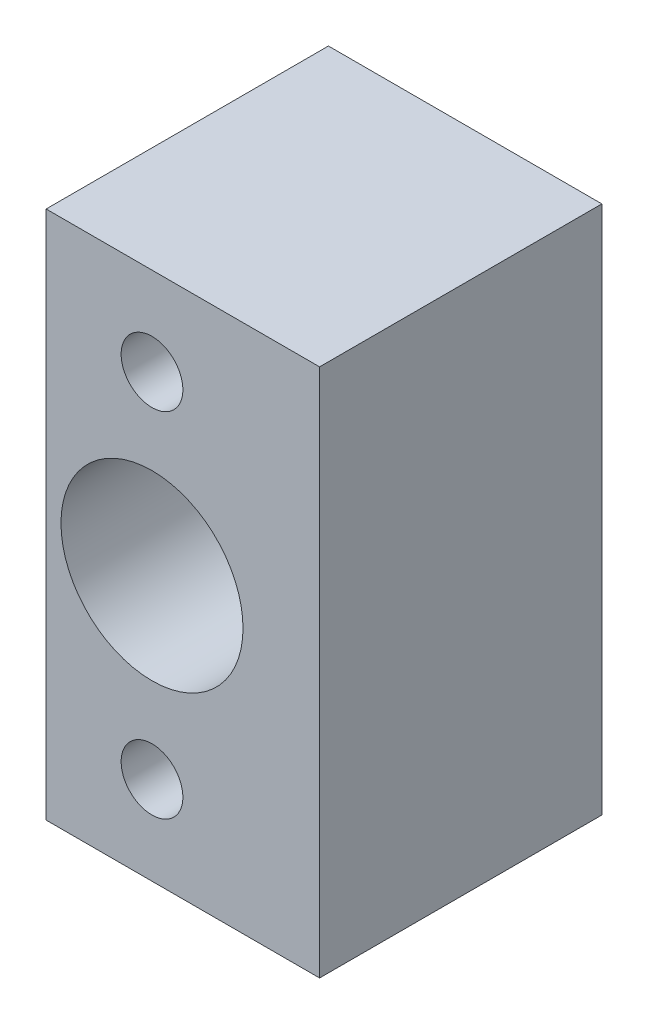
ISO-10303-21;
HEADER;
FILE_DESCRIPTION(('STEP AP214'),'2;1');
FILE_NAME('part.step','',(''),(''),'','','');
FILE_SCHEMA(('AUTOMOTIVE_DESIGN { 1 0 10303 214 1 1 1 1 }'));
ENDSEC;
DATA;
#1=APPLICATION_CONTEXT('core data for automotive mechanical design processes');
#2=APPLICATION_PROTOCOL_DEFINITION('international standard','automotive_design',2000,#1);
#3=PRODUCT_CONTEXT('',#1,'mechanical');
#4=PRODUCT('Part','Part','',(#3));
#5=PRODUCT_RELATED_PRODUCT_CATEGORY('part','',(#4));
#6=PRODUCT_DEFINITION_FORMATION('','',#4);
#7=PRODUCT_DEFINITION_CONTEXT('part definition',#1,'design');
#8=PRODUCT_DEFINITION('design','',#6,#7);
#9=PRODUCT_DEFINITION_SHAPE('','',#8);
#10=(LENGTH_UNIT() NAMED_UNIT(*) SI_UNIT(.MILLI.,.METRE.));
#11=(NAMED_UNIT(*) PLANE_ANGLE_UNIT() SI_UNIT($,.RADIAN.));
#12=(NAMED_UNIT(*) SI_UNIT($,.STERADIAN.) SOLID_ANGLE_UNIT());
#13=UNCERTAINTY_MEASURE_WITH_UNIT(LENGTH_MEASURE(1.E-05),#10,'distance_accuracy_value','');
#14=(GEOMETRIC_REPRESENTATION_CONTEXT(3) GLOBAL_UNCERTAINTY_ASSIGNED_CONTEXT((#13)) GLOBAL_UNIT_ASSIGNED_CONTEXT((#10,
#11,#12)) REPRESENTATION_CONTEXT('',''));
#15=CARTESIAN_POINT('',(0.,0.,0.));
#16=DIRECTION('',(0.,0.,1.));
#17=DIRECTION('',(1.,0.,0.));
#18=AXIS2_PLACEMENT_3D('',#15,#16,#17);
#19=CARTESIAN_POINT('',(0.,9.99999999999999,18.));
#20=DIRECTION('',(0.,0.,-1.));
#21=DIRECTION('',(-1.,0.,0.));
#22=AXIS2_PLACEMENT_3D('',#19,#20,#21);
#23=CYLINDRICAL_SURFACE('',#22,1.75);
#24=CARTESIAN_POINT('',(0.,9.99999999999999,16.));
#25=DIRECTION('',(0.,0.,-1.));
#26=DIRECTION('',(-1.,0.,0.));
#27=AXIS2_PLACEMENT_3D('',#24,#25,#26);
#28=CIRCLE('',#27,1.75);
#29=CARTESIAN_POINT('',(-1.75,9.99999999999999,16.));
#30=VERTEX_POINT('',#29);
#31=EDGE_CURVE('E129',#30,#30,#28,.F.);
#32=ORIENTED_EDGE('',*,*,#31,.T.);
#33=EDGE_LOOP('',(#32));
#34=FACE_BOUND('',#33,.T.);
#35=CARTESIAN_POINT('',(0.,9.99999999999999,4.));
#36=DIRECTION('',(0.,0.,-1.));
#37=DIRECTION('',(-1.,0.,0.));
#38=AXIS2_PLACEMENT_3D('',#35,#36,#37);
#39=CIRCLE('',#38,1.75);
#40=CARTESIAN_POINT('',(-1.75,9.99999999999999,4.));
#41=VERTEX_POINT('',#40);
#42=EDGE_CURVE('E42',#41,#41,#39,.F.);
#43=ORIENTED_EDGE('',*,*,#42,.F.);
#44=EDGE_LOOP('',(#43));
#45=FACE_BOUND('',#44,.T.);
#46=ADVANCED_FACE('F38',(#34,#45),#23,.F.);
#47=CARTESIAN_POINT('',(0.,-10.,18.));
#48=DIRECTION('',(0.,0.,-1.));
#49=DIRECTION('',(-1.,0.,0.));
#50=AXIS2_PLACEMENT_3D('',#47,#48,#49);
#51=CYLINDRICAL_SURFACE('',#50,1.75);
#52=CARTESIAN_POINT('',(0.,-10.,16.));
#53=DIRECTION('',(0.,0.,-1.));
#54=DIRECTION('',(-1.,0.,0.));
#55=AXIS2_PLACEMENT_3D('',#52,#53,#54);
#56=CIRCLE('',#55,1.75);
#57=CARTESIAN_POINT('',(-1.75,-10.,16.));
#58=VERTEX_POINT('',#57);
#59=EDGE_CURVE('E127',#58,#58,#56,.F.);
#60=ORIENTED_EDGE('',*,*,#59,.T.);
#61=EDGE_LOOP('',(#60));
#62=FACE_BOUND('',#61,.T.);
#63=CARTESIAN_POINT('',(0.,-10.,4.));
#64=DIRECTION('',(0.,0.,-1.));
#65=DIRECTION('',(-1.,0.,0.));
#66=AXIS2_PLACEMENT_3D('',#63,#64,#65);
#67=CIRCLE('',#66,1.75);
#68=CARTESIAN_POINT('',(-1.75,-10.,4.));
#69=VERTEX_POINT('',#68);
#70=EDGE_CURVE('E131',#69,#69,#67,.F.);
#71=ORIENTED_EDGE('',*,*,#70,.F.);
#72=EDGE_LOOP('',(#71));
#73=FACE_BOUND('',#72,.T.);
#74=ADVANCED_FACE('F184',(#62,#73),#51,.F.);
#75=CARTESIAN_POINT('',(0.,0.,2.9));
#76=DIRECTION('',(0.,0.,-1.));
#77=DIRECTION('',(-1.,0.,0.));
#78=AXIS2_PLACEMENT_3D('',#75,#76,#77);
#79=CYLINDRICAL_SURFACE('',#78,4.);
#80=CARTESIAN_POINT('',(0.,0.,2.9));
#81=DIRECTION('',(0.,0.,-1.));
#82=DIRECTION('',(-1.,0.,0.));
#83=AXIS2_PLACEMENT_3D('',#80,#81,#82);
#84=CIRCLE('',#83,4.);
#85=CARTESIAN_POINT('',(-4.,0.,2.9));
#86=VERTEX_POINT('',#85);
#87=EDGE_CURVE('E109',#86,#86,#84,.T.);
#88=ORIENTED_EDGE('',*,*,#87,.F.);
#89=EDGE_LOOP('',(#88));
#90=FACE_BOUND('',#89,.T.);
#91=CARTESIAN_POINT('',(0.,0.,0.));
#92=DIRECTION('',(0.,0.,-1.));
#93=DIRECTION('',(-1.,0.,0.));
#94=AXIS2_PLACEMENT_3D('',#91,#92,#93);
#95=CIRCLE('',#94,4.);
#96=CARTESIAN_POINT('',(-4.,0.,0.));
#97=VERTEX_POINT('',#96);
#98=EDGE_CURVE('E159',#97,#97,#95,.F.);
#99=ORIENTED_EDGE('',*,*,#98,.F.);
#100=EDGE_LOOP('',(#99));
#101=FACE_BOUND('',#100,.T.);
#102=ADVANCED_FACE('F180',(#90,#101),#79,.F.);
#103=CARTESIAN_POINT('',(0.,0.,18.));
#104=DIRECTION('',(0.,0.,-1.));
#105=DIRECTION('',(-1.,0.,0.));
#106=AXIS2_PLACEMENT_3D('',#103,#104,#105);
#107=CYLINDRICAL_SURFACE('',#106,2.38125);
#108=CARTESIAN_POINT('',(0.,0.,5.99999999999999));
#109=DIRECTION('',(0.,0.,1.));
#110=DIRECTION('',(1.,0.,0.));
#111=AXIS2_PLACEMENT_3D('',#108,#109,#110);
#112=CIRCLE('',#111,2.38125);
#113=CARTESIAN_POINT('',(2.38125,0.,5.99999999999999));
#114=VERTEX_POINT('',#113);
#115=EDGE_CURVE('E100',#114,#114,#112,.F.);
#116=ORIENTED_EDGE('',*,*,#115,.F.);
#117=EDGE_LOOP('',(#116));
#118=FACE_BOUND('',#117,.T.);
#119=CARTESIAN_POINT('',(0.,0.,2.9));
#120=DIRECTION('',(0.,0.,-1.));
#121=DIRECTION('',(-1.,0.,0.));
#122=AXIS2_PLACEMENT_3D('',#119,#120,#121);
#123=CIRCLE('',#122,2.38125);
#124=CARTESIAN_POINT('',(-2.38125,0.,2.9));
#125=VERTEX_POINT('',#124);
#126=EDGE_CURVE('E106',#125,#125,#123,.T.);
#127=ORIENTED_EDGE('',*,*,#126,.T.);
#128=EDGE_LOOP('',(#127));
#129=FACE_BOUND('',#128,.T.);
#130=ADVANCED_FACE('F183',(#118,#129),#107,.F.);
#131=CARTESIAN_POINT('',(0.,0.,6.5));
#132=DIRECTION('',(0.,0.,1.));
#133=DIRECTION('',(1.,0.,0.));
#134=AXIS2_PLACEMENT_3D('',#131,#132,#133);
#135=CYLINDRICAL_SURFACE('',#134,5.159375);
#136=CARTESIAN_POINT('',(0.,0.,16.));
#137=DIRECTION('',(0.,0.,-1.));
#138=DIRECTION('',(-1.,0.,0.));
#139=AXIS2_PLACEMENT_3D('',#136,#137,#138);
#140=CIRCLE('',#139,5.159375);
#141=CARTESIAN_POINT('',(-5.159375,0.,16.));
#142=VERTEX_POINT('',#141);
#143=EDGE_CURVE('E170',#142,#142,#140,.F.);
#144=ORIENTED_EDGE('',*,*,#143,.T.);
#145=EDGE_LOOP('',(#144));
#146=FACE_BOUND('',#145,.T.);
#147=CARTESIAN_POINT('',(0.,0.,6.5));
#148=DIRECTION('',(0.,0.,1.));
#149=DIRECTION('',(1.,0.,0.));
#150=AXIS2_PLACEMENT_3D('',#147,#148,#149);
#151=CIRCLE('',#150,5.159375);
#152=CARTESIAN_POINT('',(5.159375,0.,6.5));
#153=VERTEX_POINT('',#152);
#154=EDGE_CURVE('E115',#153,#153,#151,.T.);
#155=ORIENTED_EDGE('',*,*,#154,.F.);
#156=EDGE_LOOP('',(#155));
#157=FACE_BOUND('',#156,.T.);
#158=ADVANCED_FACE('F219',(#146,#157),#135,.F.);
#159=CARTESIAN_POINT('',(0.,0.,6.5));
#160=DIRECTION('',(0.,0.,1.));
#161=DIRECTION('',(1.,0.,0.));
#162=AXIS2_PLACEMENT_3D('',#159,#160,#161);
#163=PLANE('',#162);
#164=CARTESIAN_POINT('',(0.,0.,6.5));
#165=DIRECTION('',(0.,0.,1.));
#166=DIRECTION('',(1.,0.,0.));
#167=AXIS2_PLACEMENT_3D('',#164,#165,#166);
#168=CIRCLE('',#167,4.8);
#169=CARTESIAN_POINT('',(4.8,0.,6.5));
#170=VERTEX_POINT('',#169);
#171=EDGE_CURVE('E104',#170,#170,#168,.T.);
#172=ORIENTED_EDGE('',*,*,#171,.F.);
#173=EDGE_LOOP('',(#172));
#174=FACE_BOUND('',#173,.T.);
#175=ORIENTED_EDGE('',*,*,#154,.T.);
#176=EDGE_LOOP('',(#175));
#177=FACE_BOUND('',#176,.T.);
#178=ADVANCED_FACE('F227',(#174,#177),#163,.T.);
#179=CARTESIAN_POINT('',(0.,0.,5.99999999999999));
#180=DIRECTION('',(0.,0.,1.));
#181=DIRECTION('',(1.,0.,0.));
#182=AXIS2_PLACEMENT_3D('',#179,#180,#181);
#183=CYLINDRICAL_SURFACE('',#182,4.8);
#184=CARTESIAN_POINT('',(0.,0.,5.99999999999999));
#185=DIRECTION('',(0.,0.,1.));
#186=DIRECTION('',(1.,0.,0.));
#187=AXIS2_PLACEMENT_3D('',#184,#185,#186);
#188=CIRCLE('',#187,4.8);
#189=CARTESIAN_POINT('',(4.8,0.,5.99999999999999));
#190=VERTEX_POINT('',#189);
#191=EDGE_CURVE('E112',#190,#190,#188,.T.);
#192=ORIENTED_EDGE('',*,*,#191,.F.);
#193=EDGE_LOOP('',(#192));
#194=FACE_BOUND('',#193,.T.);
#195=ORIENTED_EDGE('',*,*,#171,.T.);
#196=EDGE_LOOP('',(#195));
#197=FACE_BOUND('',#196,.T.);
#198=ADVANCED_FACE('F223',(#194,#197),#183,.F.);
#199=CARTESIAN_POINT('',(0.,0.,5.99999999999999));
#200=DIRECTION('',(0.,0.,1.));
#201=DIRECTION('',(1.,0.,0.));
#202=AXIS2_PLACEMENT_3D('',#199,#200,#201);
#203=PLANE('',#202);
#204=ORIENTED_EDGE('',*,*,#115,.T.);
#205=EDGE_LOOP('',(#204));
#206=FACE_BOUND('',#205,.T.);
#207=ORIENTED_EDGE('',*,*,#191,.T.);
#208=EDGE_LOOP('',(#207));
#209=FACE_BOUND('',#208,.T.);
#210=ADVANCED_FACE('F199',(#206,#209),#203,.T.);
#211=CARTESIAN_POINT('',(0.,0.,2.9));
#212=DIRECTION('',(0.,0.,-1.));
#213=DIRECTION('',(-1.,0.,0.));
#214=AXIS2_PLACEMENT_3D('',#211,#212,#213);
#215=PLANE('',#214);
#216=ORIENTED_EDGE('',*,*,#126,.F.);
#217=EDGE_LOOP('',(#216));
#218=FACE_BOUND('',#217,.T.);
#219=ORIENTED_EDGE('',*,*,#87,.T.);
#220=EDGE_LOOP('',(#219));
#221=FACE_BOUND('',#220,.T.);
#222=ADVANCED_FACE('F178',(#218,#221),#215,.T.);
#223=CARTESIAN_POINT('',(-6.00000000000001,26.,0.));
#224=DIRECTION('',(0.,0.,-1.));
#225=DIRECTION('',(-1.,0.,0.));
#226=AXIS2_PLACEMENT_3D('',#223,#224,#225);
#227=PLANE('',#226);
#228=CARTESIAN_POINT('',(0.,9.99999999999999,0.));
#229=DIRECTION('',(0.,0.,-1.));
#230=DIRECTION('',(-1.,0.,0.));
#231=AXIS2_PLACEMENT_3D('',#228,#229,#230);
#232=CIRCLE('',#231,3.81);
#233=CARTESIAN_POINT('',(-3.81,9.99999999999999,0.));
#234=VERTEX_POINT('',#233);
#235=EDGE_CURVE('E138',#234,#234,#232,.T.);
#236=ORIENTED_EDGE('',*,*,#235,.F.);
#237=EDGE_LOOP('',(#236));
#238=FACE_BOUND('',#237,.T.);
#239=CARTESIAN_POINT('',(0.,-10.,0.));
#240=DIRECTION('',(0.,0.,-1.));
#241=DIRECTION('',(-1.,0.,0.));
#242=AXIS2_PLACEMENT_3D('',#239,#240,#241);
#243=CIRCLE('',#242,3.81);
#244=CARTESIAN_POINT('',(-3.81,-10.,0.));
#245=VERTEX_POINT('',#244);
#246=EDGE_CURVE('E148',#245,#245,#243,.T.);
#247=ORIENTED_EDGE('',*,*,#246,.F.);
#248=EDGE_LOOP('',(#247));
#249=FACE_BOUND('',#248,.T.);
#250=DIRECTION('',(0.888425906857429,-0.459020051876338,0.));
#251=VECTOR('',#250,1.);
#252=CARTESIAN_POINT('',(-21.7041356787765,-4.39510131376101,0.));
#253=LINE('',#252,#251);
#254=CARTESIAN_POINT('',(-6.,-12.5089047477955,0.));
#255=VERTEX_POINT('',#254);
#256=CARTESIAN_POINT('',(-1.17852531831396,-15.,0.));
#257=VERTEX_POINT('',#256);
#258=EDGE_CURVE('E55',#255,#257,#253,.T.);
#259=ORIENTED_EDGE('',*,*,#258,.F.);
#260=DIRECTION('',(0.,-1.,0.));
#261=VECTOR('',#260,1.);
#262=CARTESIAN_POINT('',(-6.00000000000001,26.,0.));
#263=LINE('',#262,#261);
#264=CARTESIAN_POINT('',(-6.00000000000001,15.,0.));
#265=VERTEX_POINT('',#264);
#266=EDGE_CURVE('E95',#265,#255,#263,.T.);
#267=ORIENTED_EDGE('',*,*,#266,.F.);
#268=DIRECTION('',(1.,0.,0.));
#269=VECTOR('',#268,1.);
#270=CARTESIAN_POINT('',(9.5,15.,0.));
#271=LINE('',#270,#269);
#272=CARTESIAN_POINT('',(9.5,15.,0.));
#273=VERTEX_POINT('',#272);
#274=EDGE_CURVE('E130',#265,#273,#271,.T.);
#275=ORIENTED_EDGE('',*,*,#274,.T.);
#276=DIRECTION('',(0.,-1.,0.));
#277=VECTOR('',#276,1.);
#278=CARTESIAN_POINT('',(9.49999999999999,26.,0.));
#279=LINE('',#278,#277);
#280=CARTESIAN_POINT('',(9.5,-15.,0.));
#281=VERTEX_POINT('',#280);
#282=EDGE_CURVE('E152',#273,#281,#279,.T.);
#283=ORIENTED_EDGE('',*,*,#282,.T.);
#284=DIRECTION('',(1.,0.,0.));
#285=VECTOR('',#284,1.);
#286=CARTESIAN_POINT('',(-6.,-15.,0.));
#287=LINE('',#286,#285);
#288=EDGE_CURVE('E155',#257,#281,#287,.T.);
#289=ORIENTED_EDGE('',*,*,#288,.F.);
#290=EDGE_LOOP('',(#259,#267,#275,#283,#289));
#291=FACE_BOUND('',#290,.T.);
#292=ORIENTED_EDGE('',*,*,#98,.T.);
#293=EDGE_LOOP('',(#292));
#294=FACE_BOUND('',#293,.T.);
#295=ADVANCED_FACE('F188',(#238,#249,#291,#294),#227,.T.);
#296=CARTESIAN_POINT('',(0.,26.,16.));
#297=DIRECTION('',(0.,0.,-1.));
#298=DIRECTION('',(-1.,0.,0.));
#299=AXIS2_PLACEMENT_3D('',#296,#297,#298);
#300=PLANE('',#299);
#301=ORIENTED_EDGE('',*,*,#31,.F.);
#302=EDGE_LOOP('',(#301));
#303=FACE_BOUND('',#302,.T.);
#304=ORIENTED_EDGE('',*,*,#59,.F.);
#305=EDGE_LOOP('',(#304));
#306=FACE_BOUND('',#305,.T.);
#307=ORIENTED_EDGE('',*,*,#143,.F.);
#308=EDGE_LOOP('',(#307));
#309=FACE_BOUND('',#308,.T.);
#310=DIRECTION('',(0.,-1.,0.));
#311=VECTOR('',#310,1.);
#312=CARTESIAN_POINT('',(-6.00000000000001,26.,16.));
#313=LINE('',#312,#311);
#314=CARTESIAN_POINT('',(-6.00000000000001,15.,16.));
#315=VERTEX_POINT('',#314);
#316=CARTESIAN_POINT('',(-6.,-15.,16.));
#317=VERTEX_POINT('',#316);
#318=EDGE_CURVE('E154',#315,#317,#313,.T.);
#319=ORIENTED_EDGE('',*,*,#318,.T.);
#320=DIRECTION('',(1.,0.,0.));
#321=VECTOR('',#320,1.);
#322=CARTESIAN_POINT('',(0.,-15.,16.));
#323=LINE('',#322,#321);
#324=CARTESIAN_POINT('',(9.5,-15.,16.));
#325=VERTEX_POINT('',#324);
#326=EDGE_CURVE('E99',#317,#325,#323,.T.);
#327=ORIENTED_EDGE('',*,*,#326,.T.);
#328=DIRECTION('',(0.,-1.,0.));
#329=VECTOR('',#328,1.);
#330=CARTESIAN_POINT('',(9.49999999999999,26.,16.));
#331=LINE('',#330,#329);
#332=CARTESIAN_POINT('',(9.5,15.,16.));
#333=VERTEX_POINT('',#332);
#334=EDGE_CURVE('E156',#333,#325,#331,.T.);
#335=ORIENTED_EDGE('',*,*,#334,.F.);
#336=DIRECTION('',(1.,0.,0.));
#337=VECTOR('',#336,1.);
#338=CARTESIAN_POINT('',(9.5,15.,16.));
#339=LINE('',#338,#337);
#340=EDGE_CURVE('E62',#315,#333,#339,.T.);
#341=ORIENTED_EDGE('',*,*,#340,.F.);
#342=EDGE_LOOP('',(#319,#327,#335,#341));
#343=FACE_BOUND('',#342,.T.);
#344=ADVANCED_FACE('F190',(#303,#306,#309,#343),#300,.F.);
#345=CARTESIAN_POINT('',(-6.00000000000001,15.,49.765073093486));
#346=DIRECTION('',(1.,0.,0.));
#347=DIRECTION('',(0.,1.,0.));
#348=AXIS2_PLACEMENT_3D('',#345,#346,#347);
#349=PLANE('',#348);
#350=ORIENTED_EDGE('',*,*,#266,.T.);
#351=DIRECTION('',(0.,-0.470588235294118,0.88235294117647));
#352=VECTOR('',#351,1.);
#353=CARTESIAN_POINT('',(-5.99999999999999,-27.0806655345063,27.3220514750826));
#354=LINE('',#353,#352);
#355=CARTESIAN_POINT('',(-6.,-15.,4.67080359788335));
#356=VERTEX_POINT('',#355);
#357=EDGE_CURVE('E85',#255,#356,#354,.T.);
#358=ORIENTED_EDGE('',*,*,#357,.T.);
#359=DIRECTION('',(0.,0.,-1.));
#360=VECTOR('',#359,1.);
#361=CARTESIAN_POINT('',(-6.,-15.,49.765073093486));
#362=LINE('',#361,#360);
#363=EDGE_CURVE('E93',#317,#356,#362,.T.);
#364=ORIENTED_EDGE('',*,*,#363,.F.);
#365=ORIENTED_EDGE('',*,*,#318,.F.);
#366=DIRECTION('',(0.,0.,-1.));
#367=VECTOR('',#366,1.);
#368=CARTESIAN_POINT('',(-6.00000000000001,15.,49.765073093486));
#369=LINE('',#368,#367);
#370=EDGE_CURVE('E101',#315,#265,#369,.T.);
#371=ORIENTED_EDGE('',*,*,#370,.T.);
#372=EDGE_LOOP('',(#350,#358,#364,#365,#371));
#373=FACE_BOUND('',#372,.T.);
#374=ADVANCED_FACE('F92',(#373),#349,.F.);
#375=CARTESIAN_POINT('',(9.5,15.,18.));
#376=DIRECTION('',(0.,-1.,0.));
#377=DIRECTION('',(1.,0.,0.));
#378=AXIS2_PLACEMENT_3D('',#375,#376,#377);
#379=PLANE('',#378);
#380=ORIENTED_EDGE('',*,*,#370,.F.);
#381=ORIENTED_EDGE('',*,*,#340,.T.);
#382=DIRECTION('',(0.,0.,-1.));
#383=VECTOR('',#382,1.);
#384=CARTESIAN_POINT('',(9.5,15.,18.));
#385=LINE('',#384,#383);
#386=EDGE_CURVE('E120',#333,#273,#385,.T.);
#387=ORIENTED_EDGE('',*,*,#386,.T.);
#388=ORIENTED_EDGE('',*,*,#274,.F.);
#389=EDGE_LOOP('',(#380,#381,#387,#388));
#390=FACE_BOUND('',#389,.T.);
#391=ADVANCED_FACE('F216',(#390),#379,.F.);
#392=CARTESIAN_POINT('',(9.5,15.,18.));
#393=DIRECTION('',(-1.,0.,0.));
#394=DIRECTION('',(0.,-1.,0.));
#395=AXIS2_PLACEMENT_3D('',#392,#393,#394);
#396=PLANE('',#395);
#397=ORIENTED_EDGE('',*,*,#386,.F.);
#398=ORIENTED_EDGE('',*,*,#334,.T.);
#399=DIRECTION('',(0.,0.,-1.));
#400=VECTOR('',#399,1.);
#401=CARTESIAN_POINT('',(9.5,-15.,18.));
#402=LINE('',#401,#400);
#403=EDGE_CURVE('E47',#325,#281,#402,.T.);
#404=ORIENTED_EDGE('',*,*,#403,.T.);
#405=ORIENTED_EDGE('',*,*,#282,.F.);
#406=EDGE_LOOP('',(#397,#398,#404,#405));
#407=FACE_BOUND('',#406,.T.);
#408=ADVANCED_FACE('F236',(#407),#396,.F.);
#409=CARTESIAN_POINT('',(9.5,-15.,18.));
#410=DIRECTION('',(0.,1.,0.));
#411=DIRECTION('',(-1.,0.,0.));
#412=AXIS2_PLACEMENT_3D('',#409,#410,#411);
#413=PLANE('',#412);
#414=ORIENTED_EDGE('',*,*,#363,.T.);
#415=DIRECTION('',(0.718240222789174,0.,-0.695795215827012));
#416=VECTOR('',#415,1.);
#417=CARTESIAN_POINT('',(-4.66527094755653,-15.,3.37778482832874));
#418=LINE('',#417,#416);
#419=EDGE_CURVE('E11',#356,#257,#418,.T.);
#420=ORIENTED_EDGE('',*,*,#419,.T.);
#421=ORIENTED_EDGE('',*,*,#288,.T.);
#422=ORIENTED_EDGE('',*,*,#403,.F.);
#423=ORIENTED_EDGE('',*,*,#326,.F.);
#424=EDGE_LOOP('',(#414,#420,#421,#422,#423));
#425=FACE_BOUND('',#424,.T.);
#426=ADVANCED_FACE('F40',(#425),#413,.F.);
#427=CARTESIAN_POINT('',(-5.17037830454784,-13.3942805894474,0.85638368562803));
#428=DIRECTION('',(0.414810847726077,0.802859705276278,0.428191842814015));
#429=DIRECTION('',(0.,-0.470588235294118,0.882352941176471));
#430=AXIS2_PLACEMENT_3D('',#427,#428,#429);
#431=PLANE('',#430);
#432=ORIENTED_EDGE('',*,*,#258,.T.);
#433=ORIENTED_EDGE('',*,*,#419,.F.);
#434=ORIENTED_EDGE('',*,*,#357,.F.);
#435=EDGE_LOOP('',(#432,#433,#434));
#436=FACE_BOUND('',#435,.T.);
#437=ADVANCED_FACE('F84',(#436),#431,.F.);
#438=CARTESIAN_POINT('',(0.,-10.,4.));
#439=DIRECTION('',(0.,0.,-1.));
#440=DIRECTION('',(-1.,0.,0.));
#441=AXIS2_PLACEMENT_3D('',#438,#439,#440);
#442=PLANE('',#441);
#443=CARTESIAN_POINT('',(0.,-10.,4.));
#444=DIRECTION('',(0.,0.,-1.));
#445=DIRECTION('',(-1.,0.,0.));
#446=AXIS2_PLACEMENT_3D('',#443,#444,#445);
#447=CIRCLE('',#446,3.81);
#448=CARTESIAN_POINT('',(-3.81,-10.,4.));
#449=VERTEX_POINT('',#448);
#450=EDGE_CURVE('E143',#449,#449,#447,.T.);
#451=ORIENTED_EDGE('',*,*,#450,.T.);
#452=EDGE_LOOP('',(#451));
#453=FACE_BOUND('',#452,.T.);
#454=ORIENTED_EDGE('',*,*,#70,.T.);
#455=EDGE_LOOP('',(#454));
#456=FACE_BOUND('',#455,.T.);
#457=ADVANCED_FACE('F248',(#453,#456),#442,.T.);
#458=CARTESIAN_POINT('',(0.,-10.,4.));
#459=DIRECTION('',(0.,0.,-1.));
#460=DIRECTION('',(-1.,0.,0.));
#461=AXIS2_PLACEMENT_3D('',#458,#459,#460);
#462=CYLINDRICAL_SURFACE('',#461,3.81);
#463=ORIENTED_EDGE('',*,*,#450,.F.);
#464=EDGE_LOOP('',(#463));
#465=FACE_BOUND('',#464,.T.);
#466=ORIENTED_EDGE('',*,*,#246,.T.);
#467=EDGE_LOOP('',(#466));
#468=FACE_BOUND('',#467,.T.);
#469=ADVANCED_FACE('F253',(#465,#468),#462,.F.);
#470=CARTESIAN_POINT('',(0.,9.99999999999999,4.));
#471=DIRECTION('',(0.,0.,-1.));
#472=DIRECTION('',(-1.,0.,0.));
#473=AXIS2_PLACEMENT_3D('',#470,#471,#472);
#474=PLANE('',#473);
#475=CARTESIAN_POINT('',(0.,9.99999999999999,4.));
#476=DIRECTION('',(0.,0.,-1.));
#477=DIRECTION('',(-1.,0.,0.));
#478=AXIS2_PLACEMENT_3D('',#475,#476,#477);
#479=CIRCLE('',#478,3.81);
#480=CARTESIAN_POINT('',(-3.81,9.99999999999999,4.));
#481=VERTEX_POINT('',#480);
#482=EDGE_CURVE('E133',#481,#481,#479,.T.);
#483=ORIENTED_EDGE('',*,*,#482,.T.);
#484=EDGE_LOOP('',(#483));
#485=FACE_BOUND('',#484,.T.);
#486=ORIENTED_EDGE('',*,*,#42,.T.);
#487=EDGE_LOOP('',(#486));
#488=FACE_BOUND('',#487,.T.);
#489=ADVANCED_FACE('F258',(#485,#488),#474,.T.);
#490=CARTESIAN_POINT('',(0.,9.99999999999999,4.));
#491=DIRECTION('',(0.,0.,-1.));
#492=DIRECTION('',(-1.,0.,0.));
#493=AXIS2_PLACEMENT_3D('',#490,#491,#492);
#494=CYLINDRICAL_SURFACE('',#493,3.81);
#495=ORIENTED_EDGE('',*,*,#482,.F.);
#496=EDGE_LOOP('',(#495));
#497=FACE_BOUND('',#496,.T.);
#498=ORIENTED_EDGE('',*,*,#235,.T.);
#499=EDGE_LOOP('',(#498));
#500=FACE_BOUND('',#499,.T.);
#501=ADVANCED_FACE('F261',(#497,#500),#494,.F.);
#502=CLOSED_SHELL('',(#46,#74,#102,#130,#158,#178,#198,#210,#222,#295,#344,#374,#391,#408,#426,
#437,#457,#469,#489,#501));
#503=MANIFOLD_SOLID_BREP('B2',#502);
#504=ADVANCED_BREP_SHAPE_REPRESENTATION('',(#18,#503),#14);
#505=SHAPE_DEFINITION_REPRESENTATION(#9,#504);
ENDSEC;
END-ISO-10303-21;
